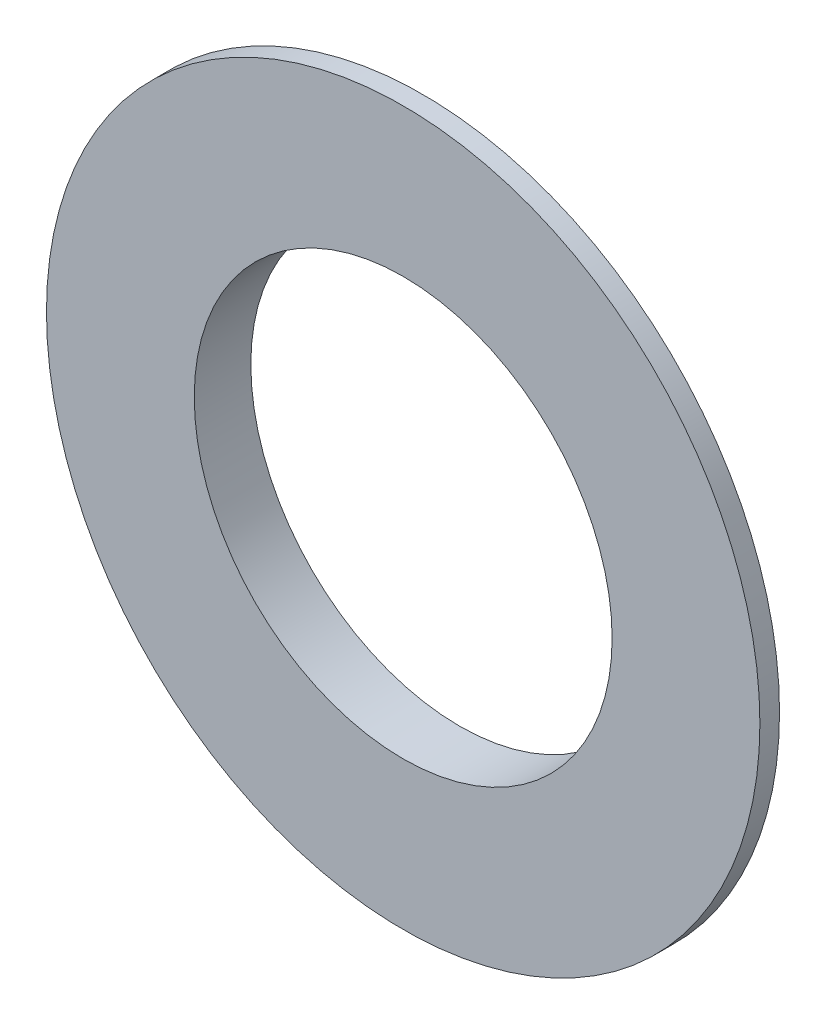
ISO-10303-21;
HEADER;
FILE_DESCRIPTION(('STEP AP214'),'2;1');
FILE_NAME('part.step','',(''),(''),'','','');
FILE_SCHEMA(('AUTOMOTIVE_DESIGN { 1 0 10303 214 1 1 1 1 }'));
ENDSEC;
DATA;
#1=APPLICATION_CONTEXT('core data for automotive mechanical design processes');
#2=APPLICATION_PROTOCOL_DEFINITION('international standard','automotive_design',2000,#1);
#3=PRODUCT_CONTEXT('',#1,'mechanical');
#4=PRODUCT('Part','Part','',(#3));
#5=PRODUCT_RELATED_PRODUCT_CATEGORY('part','',(#4));
#6=PRODUCT_DEFINITION_FORMATION('','',#4);
#7=PRODUCT_DEFINITION_CONTEXT('part definition',#1,'design');
#8=PRODUCT_DEFINITION('design','',#6,#7);
#9=PRODUCT_DEFINITION_SHAPE('','',#8);
#10=(LENGTH_UNIT() NAMED_UNIT(*) SI_UNIT(.MILLI.,.METRE.));
#11=(NAMED_UNIT(*) PLANE_ANGLE_UNIT() SI_UNIT($,.RADIAN.));
#12=(NAMED_UNIT(*) SI_UNIT($,.STERADIAN.) SOLID_ANGLE_UNIT());
#13=UNCERTAINTY_MEASURE_WITH_UNIT(LENGTH_MEASURE(1.E-05),#10,'distance_accuracy_value','');
#14=(GEOMETRIC_REPRESENTATION_CONTEXT(3) GLOBAL_UNCERTAINTY_ASSIGNED_CONTEXT((#13)) GLOBAL_UNIT_ASSIGNED_CONTEXT((#10,
#11,#12)) REPRESENTATION_CONTEXT('',''));
#15=CARTESIAN_POINT('',(0.,0.,0.));
#16=DIRECTION('',(0.,0.,1.));
#17=DIRECTION('',(1.,0.,0.));
#18=AXIS2_PLACEMENT_3D('',#15,#16,#17);
#19=CARTESIAN_POINT('',(-11.08,0.,0.));
#20=DIRECTION('',(0.,0.,-1.));
#21=DIRECTION('',(-1.,0.,0.));
#22=AXIS2_PLACEMENT_3D('',#19,#20,#21);
#23=PLANE('',#22);
#24=CARTESIAN_POINT('',(0.,0.,0.));
#25=DIRECTION('',(0.,0.,1.));
#26=DIRECTION('',(1.,0.,0.));
#27=AXIS2_PLACEMENT_3D('',#24,#25,#26);
#28=CIRCLE('',#27,11.08);
#29=CARTESIAN_POINT('',(11.08,0.,0.));
#30=VERTEX_POINT('',#29);
#31=EDGE_CURVE('E53',#30,#30,#28,.T.);
#32=ORIENTED_EDGE('',*,*,#31,.F.);
#33=EDGE_LOOP('',(#32));
#34=FACE_BOUND('',#33,.T.);
#35=CARTESIAN_POINT('',(0.,0.,0.));
#36=DIRECTION('',(0.,0.,1.));
#37=DIRECTION('',(1.,0.,0.));
#38=AXIS2_PLACEMENT_3D('',#35,#36,#37);
#39=CIRCLE('',#38,18.9167346938775);
#40=CARTESIAN_POINT('',(18.9167346938775,0.,0.));
#41=VERTEX_POINT('',#40);
#42=EDGE_CURVE('E10',#41,#41,#39,.T.);
#43=ORIENTED_EDGE('',*,*,#42,.T.);
#44=EDGE_LOOP('',(#43));
#45=FACE_BOUND('',#44,.T.);
#46=ADVANCED_FACE('F39',(#34,#45),#23,.F.);
#47=CARTESIAN_POINT('',(0.,0.,0.));
#48=DIRECTION('',(0.,0.,1.));
#49=DIRECTION('',(1.,0.,0.));
#50=AXIS2_PLACEMENT_3D('',#47,#48,#49);
#51=CYLINDRICAL_SURFACE('',#50,18.9167346938775);
#52=ORIENTED_EDGE('',*,*,#42,.F.);
#53=EDGE_LOOP('',(#52));
#54=FACE_BOUND('',#53,.T.);
#55=CARTESIAN_POINT('',(0.,0.,-1.0408163265306));
#56=DIRECTION('',(0.,0.,1.));
#57=DIRECTION('',(1.,0.,0.));
#58=AXIS2_PLACEMENT_3D('',#55,#56,#57);
#59=CIRCLE('',#58,18.9167346938775);
#60=CARTESIAN_POINT('',(18.9167346938775,0.,-1.0408163265306));
#61=VERTEX_POINT('',#60);
#62=EDGE_CURVE('E45',#61,#61,#59,.T.);
#63=ORIENTED_EDGE('',*,*,#62,.T.);
#64=EDGE_LOOP('',(#63));
#65=FACE_BOUND('',#64,.T.);
#66=ADVANCED_FACE('F62',(#54,#65),#51,.T.);
#67=CARTESIAN_POINT('',(0.,0.,-3.));
#68=DIRECTION('',(0.,0.,1.));
#69=DIRECTION('',(1.,0.,0.));
#70=AXIS2_PLACEMENT_3D('',#67,#68,#69);
#71=CONICAL_SURFACE('',#70,11.08,1.32581766366803);
#72=ORIENTED_EDGE('',*,*,#62,.F.);
#73=EDGE_LOOP('',(#72));
#74=FACE_BOUND('',#73,.T.);
#75=CARTESIAN_POINT('',(0.,0.,-3.));
#76=DIRECTION('',(0.,0.,1.));
#77=DIRECTION('',(1.,0.,0.));
#78=AXIS2_PLACEMENT_3D('',#75,#76,#77);
#79=CIRCLE('',#78,11.08);
#80=CARTESIAN_POINT('',(11.08,0.,-3.));
#81=VERTEX_POINT('',#80);
#82=EDGE_CURVE('E49',#81,#81,#79,.T.);
#83=ORIENTED_EDGE('',*,*,#82,.T.);
#84=EDGE_LOOP('',(#83));
#85=FACE_BOUND('',#84,.T.);
#86=ADVANCED_FACE('F66',(#74,#85),#71,.T.);
#87=CARTESIAN_POINT('',(0.,0.,0.));
#88=DIRECTION('',(0.,0.,1.));
#89=DIRECTION('',(1.,0.,0.));
#90=AXIS2_PLACEMENT_3D('',#87,#88,#89);
#91=CYLINDRICAL_SURFACE('',#90,11.08);
#92=ORIENTED_EDGE('',*,*,#82,.F.);
#93=EDGE_LOOP('',(#92));
#94=FACE_BOUND('',#93,.T.);
#95=ORIENTED_EDGE('',*,*,#31,.T.);
#96=EDGE_LOOP('',(#95));
#97=FACE_BOUND('',#96,.T.);
#98=ADVANCED_FACE('F59',(#94,#97),#91,.F.);
#99=CLOSED_SHELL('',(#46,#66,#86,#98));
#100=MANIFOLD_SOLID_BREP('B2',#99);
#101=ADVANCED_BREP_SHAPE_REPRESENTATION('',(#18,#100),#14);
#102=SHAPE_DEFINITION_REPRESENTATION(#9,#101);
ENDSEC;
END-ISO-10303-21;
